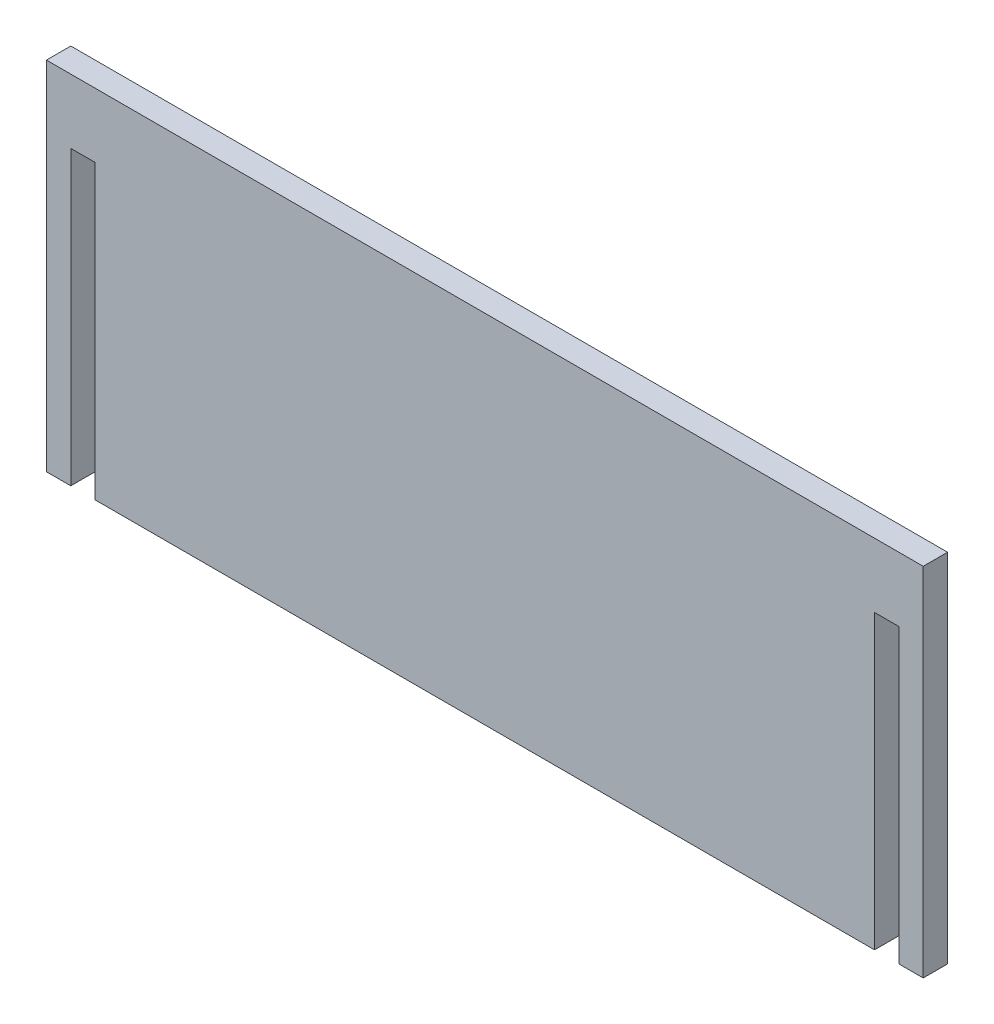
ISO-10303-21;
HEADER;
FILE_DESCRIPTION(('STEP AP214'),'2;1');
FILE_NAME('part.step','',(''),(''),'','','');
FILE_SCHEMA(('AUTOMOTIVE_DESIGN { 1 0 10303 214 1 1 1 1 }'));
ENDSEC;
DATA;
#1=APPLICATION_CONTEXT('core data for automotive mechanical design processes');
#2=APPLICATION_PROTOCOL_DEFINITION('international standard','automotive_design',2000,#1);
#3=PRODUCT_CONTEXT('',#1,'mechanical');
#4=PRODUCT('Part','Part','',(#3));
#5=PRODUCT_RELATED_PRODUCT_CATEGORY('part','',(#4));
#6=PRODUCT_DEFINITION_FORMATION('','',#4);
#7=PRODUCT_DEFINITION_CONTEXT('part definition',#1,'design');
#8=PRODUCT_DEFINITION('design','',#6,#7);
#9=PRODUCT_DEFINITION_SHAPE('','',#8);
#10=(LENGTH_UNIT() NAMED_UNIT(*) SI_UNIT(.MILLI.,.METRE.));
#11=(NAMED_UNIT(*) PLANE_ANGLE_UNIT() SI_UNIT($,.RADIAN.));
#12=(NAMED_UNIT(*) SI_UNIT($,.STERADIAN.) SOLID_ANGLE_UNIT());
#13=UNCERTAINTY_MEASURE_WITH_UNIT(LENGTH_MEASURE(1.E-05),#10,'distance_accuracy_value','');
#14=(GEOMETRIC_REPRESENTATION_CONTEXT(3) GLOBAL_UNCERTAINTY_ASSIGNED_CONTEXT((#13)) GLOBAL_UNIT_ASSIGNED_CONTEXT((#10,
#11,#12)) REPRESENTATION_CONTEXT('',''));
#15=CARTESIAN_POINT('',(0.,0.,0.));
#16=DIRECTION('',(0.,0.,1.));
#17=DIRECTION('',(1.,0.,0.));
#18=AXIS2_PLACEMENT_3D('',#15,#16,#17);
#19=CARTESIAN_POINT('',(0.,0.,3.175));
#20=DIRECTION('',(0.,1.,0.));
#21=DIRECTION('',(0.,0.,1.));
#22=AXIS2_PLACEMENT_3D('',#19,#20,#21);
#23=PLANE('',#22);
#24=DIRECTION('',(1.,0.,0.));
#25=VECTOR('',#24,1.);
#26=CARTESIAN_POINT('',(0.,0.,0.));
#27=LINE('',#26,#25);
#28=CARTESIAN_POINT('',(0.,0.,0.));
#29=VERTEX_POINT('',#28);
#30=CARTESIAN_POINT('',(3.175,0.,0.));
#31=VERTEX_POINT('',#30);
#32=EDGE_CURVE('E144',#29,#31,#27,.T.);
#33=ORIENTED_EDGE('',*,*,#32,.T.);
#34=DIRECTION('',(0.,0.,1.));
#35=VECTOR('',#34,1.);
#36=CARTESIAN_POINT('',(3.175,0.,0.));
#37=LINE('',#36,#35);
#38=CARTESIAN_POINT('',(3.175,0.,3.175));
#39=VERTEX_POINT('',#38);
#40=EDGE_CURVE('E129',#31,#39,#37,.T.);
#41=ORIENTED_EDGE('',*,*,#40,.T.);
#42=DIRECTION('',(1.,0.,0.));
#43=VECTOR('',#42,1.);
#44=CARTESIAN_POINT('',(0.,0.,3.175));
#45=LINE('',#44,#43);
#46=CARTESIAN_POINT('',(0.,0.,3.175));
#47=VERTEX_POINT('',#46);
#48=EDGE_CURVE('E185',#47,#39,#45,.T.);
#49=ORIENTED_EDGE('',*,*,#48,.F.);
#50=DIRECTION('',(0.,0.,-1.));
#51=VECTOR('',#50,1.);
#52=CARTESIAN_POINT('',(0.,0.,3.175));
#53=LINE('',#52,#51);
#54=EDGE_CURVE('E11',#47,#29,#53,.T.);
#55=ORIENTED_EDGE('',*,*,#54,.T.);
#56=EDGE_LOOP('',(#33,#41,#49,#55));
#57=FACE_BOUND('',#56,.T.);
#58=ADVANCED_FACE('F39',(#57),#23,.F.);
#59=CARTESIAN_POINT('',(111.125,0.,3.175));
#60=VERTEX_POINT('',#59);
#61=CARTESIAN_POINT('',(114.3,0.,3.175));
#62=VERTEX_POINT('',#61);
#63=EDGE_CURVE('E189',#60,#62,#45,.T.);
#64=ORIENTED_EDGE('',*,*,#63,.F.);
#65=DIRECTION('',(0.,0.,1.));
#66=VECTOR('',#65,1.);
#67=CARTESIAN_POINT('',(111.125,0.,0.));
#68=LINE('',#67,#66);
#69=CARTESIAN_POINT('',(111.125,0.,0.));
#70=VERTEX_POINT('',#69);
#71=EDGE_CURVE('E204',#70,#60,#68,.T.);
#72=ORIENTED_EDGE('',*,*,#71,.F.);
#73=CARTESIAN_POINT('',(114.3,0.,0.));
#74=VERTEX_POINT('',#73);
#75=EDGE_CURVE('E156',#70,#74,#27,.T.);
#76=ORIENTED_EDGE('',*,*,#75,.T.);
#77=DIRECTION('',(0.,0.,-1.));
#78=VECTOR('',#77,1.);
#79=CARTESIAN_POINT('',(114.3,0.,3.175));
#80=LINE('',#79,#78);
#81=EDGE_CURVE('E48',#62,#74,#80,.T.);
#82=ORIENTED_EDGE('',*,*,#81,.F.);
#83=EDGE_LOOP('',(#64,#72,#76,#82));
#84=FACE_BOUND('',#83,.T.);
#85=ADVANCED_FACE('F263',(#84),#23,.F.);
#86=CARTESIAN_POINT('',(0.,0.,3.175));
#87=DIRECTION('',(1.,0.,0.));
#88=DIRECTION('',(0.,0.,-1.));
#89=AXIS2_PLACEMENT_3D('',#86,#87,#88);
#90=PLANE('',#89);
#91=DIRECTION('',(0.,-1.,0.));
#92=VECTOR('',#91,1.);
#93=CARTESIAN_POINT('',(0.,0.,0.));
#94=LINE('',#93,#92);
#95=CARTESIAN_POINT('',(0.,46.482,0.));
#96=VERTEX_POINT('',#95);
#97=EDGE_CURVE('E164',#96,#29,#94,.T.);
#98=ORIENTED_EDGE('',*,*,#97,.T.);
#99=ORIENTED_EDGE('',*,*,#54,.F.);
#100=DIRECTION('',(0.,-1.,0.));
#101=VECTOR('',#100,1.);
#102=CARTESIAN_POINT('',(0.,0.,3.175));
#103=LINE('',#102,#101);
#104=CARTESIAN_POINT('',(0.,46.482,3.175));
#105=VERTEX_POINT('',#104);
#106=EDGE_CURVE('E190',#105,#47,#103,.T.);
#107=ORIENTED_EDGE('',*,*,#106,.F.);
#108=DIRECTION('',(0.,0.,-1.));
#109=VECTOR('',#108,1.);
#110=CARTESIAN_POINT('',(0.,46.482,3.175));
#111=LINE('',#110,#109);
#112=EDGE_CURVE('E181',#105,#96,#111,.T.);
#113=ORIENTED_EDGE('',*,*,#112,.T.);
#114=EDGE_LOOP('',(#98,#99,#107,#113));
#115=FACE_BOUND('',#114,.T.);
#116=ADVANCED_FACE('F41',(#115),#90,.F.);
#117=CARTESIAN_POINT('',(6.35,0.,3.175));
#118=VERTEX_POINT('',#117);
#119=CARTESIAN_POINT('',(107.95,0.,3.175));
#120=VERTEX_POINT('',#119);
#121=EDGE_CURVE('E188',#118,#120,#45,.T.);
#122=ORIENTED_EDGE('',*,*,#121,.F.);
#123=DIRECTION('',(0.,0.,1.));
#124=VECTOR('',#123,1.);
#125=CARTESIAN_POINT('',(6.35,0.,0.));
#126=LINE('',#125,#124);
#127=CARTESIAN_POINT('',(6.35,0.,0.));
#128=VERTEX_POINT('',#127);
#129=EDGE_CURVE('E139',#128,#118,#126,.T.);
#130=ORIENTED_EDGE('',*,*,#129,.F.);
#131=CARTESIAN_POINT('',(107.95,0.,0.));
#132=VERTEX_POINT('',#131);
#133=EDGE_CURVE('E154',#128,#132,#27,.T.);
#134=ORIENTED_EDGE('',*,*,#133,.T.);
#135=DIRECTION('',(0.,0.,1.));
#136=VECTOR('',#135,1.);
#137=CARTESIAN_POINT('',(107.95,0.,0.));
#138=LINE('',#137,#136);
#139=EDGE_CURVE('E200',#132,#120,#138,.T.);
#140=ORIENTED_EDGE('',*,*,#139,.T.);
#141=EDGE_LOOP('',(#122,#130,#134,#140));
#142=FACE_BOUND('',#141,.T.);
#143=ADVANCED_FACE('F251',(#142),#23,.F.);
#144=CARTESIAN_POINT('',(114.3,0.,3.175));
#145=DIRECTION('',(-1.,0.,0.));
#146=DIRECTION('',(0.,0.,1.));
#147=AXIS2_PLACEMENT_3D('',#144,#145,#146);
#148=PLANE('',#147);
#149=DIRECTION('',(0.,1.,0.));
#150=VECTOR('',#149,1.);
#151=CARTESIAN_POINT('',(114.3,0.,0.));
#152=LINE('',#151,#150);
#153=CARTESIAN_POINT('',(114.3,46.482,0.));
#154=VERTEX_POINT('',#153);
#155=EDGE_CURVE('E153',#74,#154,#152,.T.);
#156=ORIENTED_EDGE('',*,*,#155,.T.);
#157=DIRECTION('',(0.,0.,-1.));
#158=VECTOR('',#157,1.);
#159=CARTESIAN_POINT('',(114.3,46.482,3.175));
#160=LINE('',#159,#158);
#161=CARTESIAN_POINT('',(114.3,46.482,3.175));
#162=VERTEX_POINT('',#161);
#163=EDGE_CURVE('E267',#162,#154,#160,.T.);
#164=ORIENTED_EDGE('',*,*,#163,.F.);
#165=DIRECTION('',(0.,1.,0.));
#166=VECTOR('',#165,1.);
#167=CARTESIAN_POINT('',(114.3,0.,3.175));
#168=LINE('',#167,#166);
#169=EDGE_CURVE('E182',#62,#162,#168,.T.);
#170=ORIENTED_EDGE('',*,*,#169,.F.);
#171=ORIENTED_EDGE('',*,*,#81,.T.);
#172=EDGE_LOOP('',(#156,#164,#170,#171));
#173=FACE_BOUND('',#172,.T.);
#174=ADVANCED_FACE('F268',(#173),#148,.F.);
#175=CARTESIAN_POINT('',(0.,46.482,3.175));
#176=DIRECTION('',(0.,-1.,0.));
#177=DIRECTION('',(0.,0.,-1.));
#178=AXIS2_PLACEMENT_3D('',#175,#176,#177);
#179=PLANE('',#178);
#180=DIRECTION('',(-1.,0.,0.));
#181=VECTOR('',#180,1.);
#182=CARTESIAN_POINT('',(0.,46.482,0.));
#183=LINE('',#182,#181);
#184=EDGE_CURVE('E159',#154,#96,#183,.T.);
#185=ORIENTED_EDGE('',*,*,#184,.T.);
#186=ORIENTED_EDGE('',*,*,#112,.F.);
#187=DIRECTION('',(-1.,0.,0.));
#188=VECTOR('',#187,1.);
#189=CARTESIAN_POINT('',(0.,46.482,3.175));
#190=LINE('',#189,#188);
#191=EDGE_CURVE('E178',#162,#105,#190,.T.);
#192=ORIENTED_EDGE('',*,*,#191,.F.);
#193=ORIENTED_EDGE('',*,*,#163,.T.);
#194=EDGE_LOOP('',(#185,#186,#192,#193));
#195=FACE_BOUND('',#194,.T.);
#196=ADVANCED_FACE('F276',(#195),#179,.F.);
#197=CARTESIAN_POINT('',(0.,0.,3.175));
#198=DIRECTION('',(0.,0.,-1.));
#199=DIRECTION('',(-1.,0.,0.));
#200=AXIS2_PLACEMENT_3D('',#197,#198,#199);
#201=PLANE('',#200);
#202=ORIENTED_EDGE('',*,*,#48,.T.);
#203=DIRECTION('',(0.,-1.,0.));
#204=VECTOR('',#203,1.);
#205=CARTESIAN_POINT('',(3.175,0.,3.175));
#206=LINE('',#205,#204);
#207=CARTESIAN_POINT('',(3.175,38.1,3.175));
#208=VERTEX_POINT('',#207);
#209=EDGE_CURVE('E134',#208,#39,#206,.T.);
#210=ORIENTED_EDGE('',*,*,#209,.F.);
#211=DIRECTION('',(-1.,0.,0.));
#212=VECTOR('',#211,1.);
#213=CARTESIAN_POINT('',(3.175,38.1,3.175));
#214=LINE('',#213,#212);
#215=CARTESIAN_POINT('',(6.35,38.1,3.175));
#216=VERTEX_POINT('',#215);
#217=EDGE_CURVE('E148',#216,#208,#214,.T.);
#218=ORIENTED_EDGE('',*,*,#217,.F.);
#219=DIRECTION('',(0.,1.,0.));
#220=VECTOR('',#219,1.);
#221=CARTESIAN_POINT('',(6.35,0.,3.175));
#222=LINE('',#221,#220);
#223=EDGE_CURVE('E235',#118,#216,#222,.T.);
#224=ORIENTED_EDGE('',*,*,#223,.F.);
#225=ORIENTED_EDGE('',*,*,#121,.T.);
#226=DIRECTION('',(0.,-1.,0.));
#227=VECTOR('',#226,1.);
#228=CARTESIAN_POINT('',(107.95,0.,3.175));
#229=LINE('',#228,#227);
#230=CARTESIAN_POINT('',(107.95,38.1,3.175));
#231=VERTEX_POINT('',#230);
#232=EDGE_CURVE('E207',#231,#120,#229,.T.);
#233=ORIENTED_EDGE('',*,*,#232,.F.);
#234=DIRECTION('',(-1.,0.,0.));
#235=VECTOR('',#234,1.);
#236=CARTESIAN_POINT('',(111.125,38.1,3.175));
#237=LINE('',#236,#235);
#238=CARTESIAN_POINT('',(111.125,38.1,3.175));
#239=VERTEX_POINT('',#238);
#240=EDGE_CURVE('E211',#239,#231,#237,.T.);
#241=ORIENTED_EDGE('',*,*,#240,.F.);
#242=DIRECTION('',(0.,1.,0.));
#243=VECTOR('',#242,1.);
#244=CARTESIAN_POINT('',(111.125,0.,3.175));
#245=LINE('',#244,#243);
#246=EDGE_CURVE('E215',#60,#239,#245,.T.);
#247=ORIENTED_EDGE('',*,*,#246,.F.);
#248=ORIENTED_EDGE('',*,*,#63,.T.);
#249=ORIENTED_EDGE('',*,*,#169,.T.);
#250=ORIENTED_EDGE('',*,*,#191,.T.);
#251=ORIENTED_EDGE('',*,*,#106,.T.);
#252=EDGE_LOOP('',(#202,#210,#218,#224,#225,#233,#241,#247,#248,#249,#250,#251));
#253=FACE_BOUND('',#252,.T.);
#254=ADVANCED_FACE('F259',(#253),#201,.F.);
#255=CARTESIAN_POINT('',(0.,0.,0.));
#256=DIRECTION('',(0.,0.,-1.));
#257=DIRECTION('',(-1.,0.,0.));
#258=AXIS2_PLACEMENT_3D('',#255,#256,#257);
#259=PLANE('',#258);
#260=DIRECTION('',(0.,-1.,0.));
#261=VECTOR('',#260,1.);
#262=CARTESIAN_POINT('',(3.175,0.,0.));
#263=LINE('',#262,#261);
#264=CARTESIAN_POINT('',(3.175,38.1,0.));
#265=VERTEX_POINT('',#264);
#266=EDGE_CURVE('E132',#265,#31,#263,.T.);
#267=ORIENTED_EDGE('',*,*,#266,.T.);
#268=ORIENTED_EDGE('',*,*,#32,.F.);
#269=ORIENTED_EDGE('',*,*,#97,.F.);
#270=ORIENTED_EDGE('',*,*,#184,.F.);
#271=ORIENTED_EDGE('',*,*,#155,.F.);
#272=ORIENTED_EDGE('',*,*,#75,.F.);
#273=DIRECTION('',(0.,1.,0.));
#274=VECTOR('',#273,1.);
#275=CARTESIAN_POINT('',(111.125,0.,0.));
#276=LINE('',#275,#274);
#277=CARTESIAN_POINT('',(111.125,38.1,0.));
#278=VERTEX_POINT('',#277);
#279=EDGE_CURVE('E210',#70,#278,#276,.T.);
#280=ORIENTED_EDGE('',*,*,#279,.T.);
#281=DIRECTION('',(-1.,0.,0.));
#282=VECTOR('',#281,1.);
#283=CARTESIAN_POINT('',(111.125,38.1,0.));
#284=LINE('',#283,#282);
#285=CARTESIAN_POINT('',(107.95,38.1,0.));
#286=VERTEX_POINT('',#285);
#287=EDGE_CURVE('E221',#278,#286,#284,.T.);
#288=ORIENTED_EDGE('',*,*,#287,.T.);
#289=DIRECTION('',(0.,-1.,0.));
#290=VECTOR('',#289,1.);
#291=CARTESIAN_POINT('',(107.95,0.,0.));
#292=LINE('',#291,#290);
#293=EDGE_CURVE('E63',#286,#132,#292,.T.);
#294=ORIENTED_EDGE('',*,*,#293,.T.);
#295=ORIENTED_EDGE('',*,*,#133,.F.);
#296=DIRECTION('',(0.,1.,0.));
#297=VECTOR('',#296,1.);
#298=CARTESIAN_POINT('',(6.35,0.,0.));
#299=LINE('',#298,#297);
#300=CARTESIAN_POINT('',(6.35,38.1,0.));
#301=VERTEX_POINT('',#300);
#302=EDGE_CURVE('E147',#128,#301,#299,.T.);
#303=ORIENTED_EDGE('',*,*,#302,.T.);
#304=DIRECTION('',(-1.,0.,0.));
#305=VECTOR('',#304,1.);
#306=CARTESIAN_POINT('',(3.175,38.1,0.));
#307=LINE('',#306,#305);
#308=EDGE_CURVE('E55',#301,#265,#307,.T.);
#309=ORIENTED_EDGE('',*,*,#308,.T.);
#310=EDGE_LOOP('',(#267,#268,#269,#270,#271,#272,#280,#288,#294,#295,#303,#309));
#311=FACE_BOUND('',#310,.T.);
#312=ADVANCED_FACE('F142',(#311),#259,.T.);
#313=CARTESIAN_POINT('',(111.125,0.,0.));
#314=DIRECTION('',(1.,0.,0.));
#315=DIRECTION('',(0.,0.,-1.));
#316=AXIS2_PLACEMENT_3D('',#313,#314,#315);
#317=PLANE('',#316);
#318=ORIENTED_EDGE('',*,*,#246,.T.);
#319=DIRECTION('',(0.,0.,1.));
#320=VECTOR('',#319,1.);
#321=CARTESIAN_POINT('',(111.125,38.1,0.));
#322=LINE('',#321,#320);
#323=EDGE_CURVE('E194',#278,#239,#322,.T.);
#324=ORIENTED_EDGE('',*,*,#323,.F.);
#325=ORIENTED_EDGE('',*,*,#279,.F.);
#326=ORIENTED_EDGE('',*,*,#71,.T.);
#327=EDGE_LOOP('',(#318,#324,#325,#326));
#328=FACE_BOUND('',#327,.T.);
#329=ADVANCED_FACE('F293',(#328),#317,.F.);
#330=CARTESIAN_POINT('',(107.95,0.,0.));
#331=DIRECTION('',(-1.,0.,0.));
#332=DIRECTION('',(0.,0.,1.));
#333=AXIS2_PLACEMENT_3D('',#330,#331,#332);
#334=PLANE('',#333);
#335=ORIENTED_EDGE('',*,*,#232,.T.);
#336=ORIENTED_EDGE('',*,*,#139,.F.);
#337=ORIENTED_EDGE('',*,*,#293,.F.);
#338=DIRECTION('',(0.,0.,1.));
#339=VECTOR('',#338,1.);
#340=CARTESIAN_POINT('',(107.95,38.1,0.));
#341=LINE('',#340,#339);
#342=EDGE_CURVE('E197',#286,#231,#341,.T.);
#343=ORIENTED_EDGE('',*,*,#342,.T.);
#344=EDGE_LOOP('',(#335,#336,#337,#343));
#345=FACE_BOUND('',#344,.T.);
#346=ADVANCED_FACE('F298',(#345),#334,.F.);
#347=CARTESIAN_POINT('',(111.125,38.1,0.));
#348=DIRECTION('',(0.,1.,0.));
#349=DIRECTION('',(0.,0.,1.));
#350=AXIS2_PLACEMENT_3D('',#347,#348,#349);
#351=PLANE('',#350);
#352=ORIENTED_EDGE('',*,*,#240,.T.);
#353=ORIENTED_EDGE('',*,*,#342,.F.);
#354=ORIENTED_EDGE('',*,*,#287,.F.);
#355=ORIENTED_EDGE('',*,*,#323,.T.);
#356=EDGE_LOOP('',(#352,#353,#354,#355));
#357=FACE_BOUND('',#356,.T.);
#358=ADVANCED_FACE('F300',(#357),#351,.F.);
#359=CARTESIAN_POINT('',(3.175,0.,0.));
#360=DIRECTION('',(-1.,0.,0.));
#361=DIRECTION('',(0.,0.,1.));
#362=AXIS2_PLACEMENT_3D('',#359,#360,#361);
#363=PLANE('',#362);
#364=ORIENTED_EDGE('',*,*,#209,.T.);
#365=ORIENTED_EDGE('',*,*,#40,.F.);
#366=ORIENTED_EDGE('',*,*,#266,.F.);
#367=DIRECTION('',(0.,0.,1.));
#368=VECTOR('',#367,1.);
#369=CARTESIAN_POINT('',(3.175,38.1,0.));
#370=LINE('',#369,#368);
#371=EDGE_CURVE('E171',#265,#208,#370,.T.);
#372=ORIENTED_EDGE('',*,*,#371,.T.);
#373=EDGE_LOOP('',(#364,#365,#366,#372));
#374=FACE_BOUND('',#373,.T.);
#375=ADVANCED_FACE('F131',(#374),#363,.F.);
#376=CARTESIAN_POINT('',(3.175,38.1,0.));
#377=DIRECTION('',(0.,1.,0.));
#378=DIRECTION('',(0.,0.,1.));
#379=AXIS2_PLACEMENT_3D('',#376,#377,#378);
#380=PLANE('',#379);
#381=ORIENTED_EDGE('',*,*,#217,.T.);
#382=ORIENTED_EDGE('',*,*,#371,.F.);
#383=ORIENTED_EDGE('',*,*,#308,.F.);
#384=DIRECTION('',(0.,0.,1.));
#385=VECTOR('',#384,1.);
#386=CARTESIAN_POINT('',(6.35,38.1,0.));
#387=LINE('',#386,#385);
#388=EDGE_CURVE('E175',#301,#216,#387,.T.);
#389=ORIENTED_EDGE('',*,*,#388,.T.);
#390=EDGE_LOOP('',(#381,#382,#383,#389));
#391=FACE_BOUND('',#390,.T.);
#392=ADVANCED_FACE('F308',(#391),#380,.F.);
#393=CARTESIAN_POINT('',(6.35,0.,0.));
#394=DIRECTION('',(1.,0.,0.));
#395=DIRECTION('',(0.,0.,-1.));
#396=AXIS2_PLACEMENT_3D('',#393,#394,#395);
#397=PLANE('',#396);
#398=ORIENTED_EDGE('',*,*,#223,.T.);
#399=ORIENTED_EDGE('',*,*,#388,.F.);
#400=ORIENTED_EDGE('',*,*,#302,.F.);
#401=ORIENTED_EDGE('',*,*,#129,.T.);
#402=EDGE_LOOP('',(#398,#399,#400,#401));
#403=FACE_BOUND('',#402,.T.);
#404=ADVANCED_FACE('F247',(#403),#397,.F.);
#405=CLOSED_SHELL('',(#58,#85,#116,#143,#174,#196,#254,#312,#329,#346,#358,#375,#392,#404));
#406=MANIFOLD_SOLID_BREP('B2',#405);
#407=ADVANCED_BREP_SHAPE_REPRESENTATION('',(#18,#406),#14);
#408=SHAPE_DEFINITION_REPRESENTATION(#9,#407);
ENDSEC;
END-ISO-10303-21;
